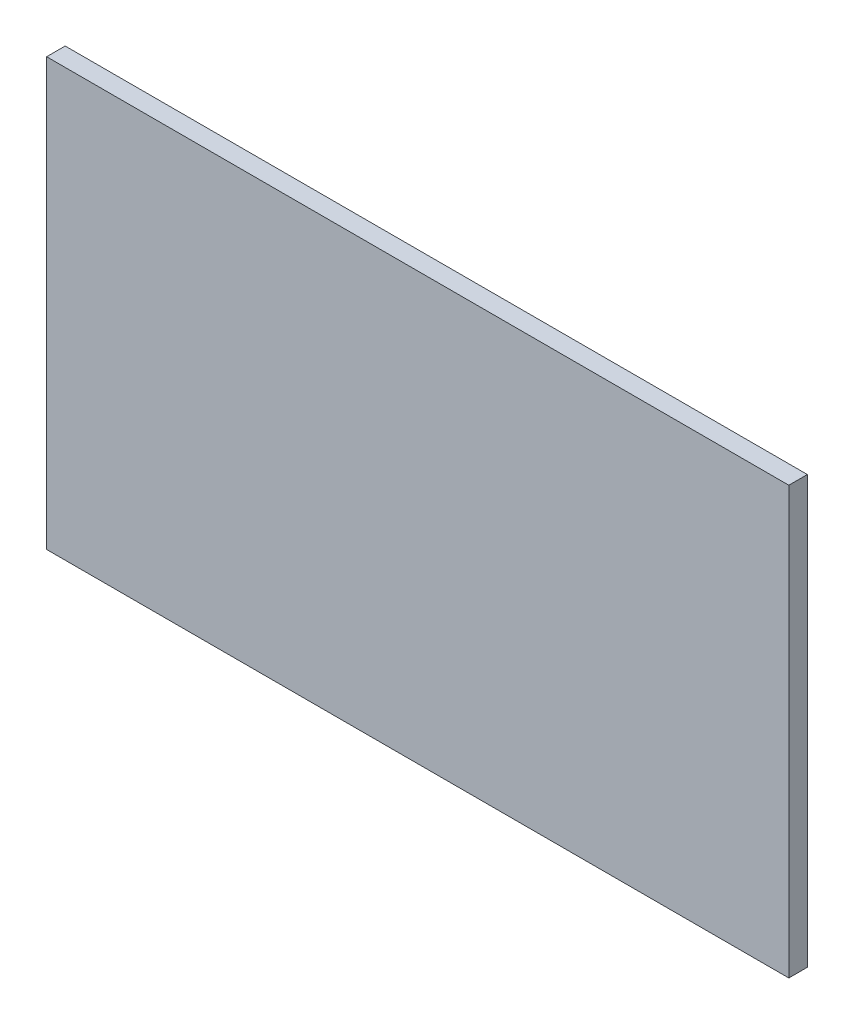
ISO-10303-21;
HEADER;
FILE_DESCRIPTION(('STEP AP214'),'2;1');
FILE_NAME('part.step','',(''),(''),'','','');
FILE_SCHEMA(('AUTOMOTIVE_DESIGN { 1 0 10303 214 1 1 1 1 }'));
ENDSEC;
DATA;
#1=APPLICATION_CONTEXT('core data for automotive mechanical design processes');
#2=APPLICATION_PROTOCOL_DEFINITION('international standard','automotive_design',2000,#1);
#3=PRODUCT_CONTEXT('',#1,'mechanical');
#4=PRODUCT('Part','Part','',(#3));
#5=PRODUCT_RELATED_PRODUCT_CATEGORY('part','',(#4));
#6=PRODUCT_DEFINITION_FORMATION('','',#4);
#7=PRODUCT_DEFINITION_CONTEXT('part definition',#1,'design');
#8=PRODUCT_DEFINITION('design','',#6,#7);
#9=PRODUCT_DEFINITION_SHAPE('','',#8);
#10=(LENGTH_UNIT() NAMED_UNIT(*) SI_UNIT(.MILLI.,.METRE.));
#11=(NAMED_UNIT(*) PLANE_ANGLE_UNIT() SI_UNIT($,.RADIAN.));
#12=(NAMED_UNIT(*) SI_UNIT($,.STERADIAN.) SOLID_ANGLE_UNIT());
#13=UNCERTAINTY_MEASURE_WITH_UNIT(LENGTH_MEASURE(1.E-05),#10,'distance_accuracy_value','');
#14=(GEOMETRIC_REPRESENTATION_CONTEXT(3) GLOBAL_UNCERTAINTY_ASSIGNED_CONTEXT((#13)) GLOBAL_UNIT_ASSIGNED_CONTEXT((#10,
#11,#12)) REPRESENTATION_CONTEXT('',''));
#15=CARTESIAN_POINT('',(0.,0.,0.));
#16=DIRECTION('',(0.,0.,1.));
#17=DIRECTION('',(1.,0.,0.));
#18=AXIS2_PLACEMENT_3D('',#15,#16,#17);
#19=CARTESIAN_POINT('',(400.,-230.,20.));
#20=DIRECTION('',(-1.,0.,0.));
#21=DIRECTION('',(0.,0.,1.));
#22=AXIS2_PLACEMENT_3D('',#19,#20,#21);
#23=PLANE('',#22);
#24=DIRECTION('',(0.,1.,0.));
#25=VECTOR('',#24,1.);
#26=CARTESIAN_POINT('',(400.,-230.,0.));
#27=LINE('',#26,#25);
#28=CARTESIAN_POINT('',(400.,-230.,0.));
#29=VERTEX_POINT('',#28);
#30=CARTESIAN_POINT('',(400.,230.,0.));
#31=VERTEX_POINT('',#30);
#32=EDGE_CURVE('E95',#29,#31,#27,.T.);
#33=ORIENTED_EDGE('',*,*,#32,.T.);
#34=DIRECTION('',(0.,0.,-1.));
#35=VECTOR('',#34,1.);
#36=CARTESIAN_POINT('',(400.,230.,20.));
#37=LINE('',#36,#35);
#38=CARTESIAN_POINT('',(400.,230.,20.));
#39=VERTEX_POINT('',#38);
#40=EDGE_CURVE('E11',#39,#31,#37,.T.);
#41=ORIENTED_EDGE('',*,*,#40,.F.);
#42=DIRECTION('',(0.,1.,0.));
#43=VECTOR('',#42,1.);
#44=CARTESIAN_POINT('',(400.,-230.,20.));
#45=LINE('',#44,#43);
#46=CARTESIAN_POINT('',(400.,-230.,20.));
#47=VERTEX_POINT('',#46);
#48=EDGE_CURVE('E83',#47,#39,#45,.T.);
#49=ORIENTED_EDGE('',*,*,#48,.F.);
#50=DIRECTION('',(0.,0.,-1.));
#51=VECTOR('',#50,1.);
#52=CARTESIAN_POINT('',(400.,-230.,20.));
#53=LINE('',#52,#51);
#54=EDGE_CURVE('E91',#47,#29,#53,.T.);
#55=ORIENTED_EDGE('',*,*,#54,.T.);
#56=EDGE_LOOP('',(#33,#41,#49,#55));
#57=FACE_BOUND('',#56,.T.);
#58=ADVANCED_FACE('F32',(#57),#23,.F.);
#59=CARTESIAN_POINT('',(-400.,230.,20.));
#60=DIRECTION('',(0.,-1.,0.));
#61=DIRECTION('',(0.,0.,-1.));
#62=AXIS2_PLACEMENT_3D('',#59,#60,#61);
#63=PLANE('',#62);
#64=DIRECTION('',(-1.,0.,0.));
#65=VECTOR('',#64,1.);
#66=CARTESIAN_POINT('',(-400.,230.,0.));
#67=LINE('',#66,#65);
#68=CARTESIAN_POINT('',(-400.,230.,0.));
#69=VERTEX_POINT('',#68);
#70=EDGE_CURVE('E87',#31,#69,#67,.T.);
#71=ORIENTED_EDGE('',*,*,#70,.T.);
#72=DIRECTION('',(0.,0.,-1.));
#73=VECTOR('',#72,1.);
#74=CARTESIAN_POINT('',(-400.,230.,20.));
#75=LINE('',#74,#73);
#76=CARTESIAN_POINT('',(-400.,230.,20.));
#77=VERTEX_POINT('',#76);
#78=EDGE_CURVE('E40',#77,#69,#75,.T.);
#79=ORIENTED_EDGE('',*,*,#78,.F.);
#80=DIRECTION('',(-1.,0.,0.));
#81=VECTOR('',#80,1.);
#82=CARTESIAN_POINT('',(-400.,230.,20.));
#83=LINE('',#82,#81);
#84=EDGE_CURVE('E78',#39,#77,#83,.T.);
#85=ORIENTED_EDGE('',*,*,#84,.F.);
#86=ORIENTED_EDGE('',*,*,#40,.T.);
#87=EDGE_LOOP('',(#71,#79,#85,#86));
#88=FACE_BOUND('',#87,.T.);
#89=ADVANCED_FACE('F86',(#88),#63,.F.);
#90=CARTESIAN_POINT('',(-400.,-230.,20.));
#91=DIRECTION('',(1.,0.,0.));
#92=DIRECTION('',(0.,0.,-1.));
#93=AXIS2_PLACEMENT_3D('',#90,#91,#92);
#94=PLANE('',#93);
#95=DIRECTION('',(0.,-1.,0.));
#96=VECTOR('',#95,1.);
#97=CARTESIAN_POINT('',(-400.,-230.,0.));
#98=LINE('',#97,#96);
#99=CARTESIAN_POINT('',(-400.,-230.,0.));
#100=VERTEX_POINT('',#99);
#101=EDGE_CURVE('E65',#69,#100,#98,.T.);
#102=ORIENTED_EDGE('',*,*,#101,.T.);
#103=DIRECTION('',(0.,0.,-1.));
#104=VECTOR('',#103,1.);
#105=CARTESIAN_POINT('',(-400.,-230.,20.));
#106=LINE('',#105,#104);
#107=CARTESIAN_POINT('',(-400.,-230.,20.));
#108=VERTEX_POINT('',#107);
#109=EDGE_CURVE('E88',#108,#100,#106,.T.);
#110=ORIENTED_EDGE('',*,*,#109,.F.);
#111=DIRECTION('',(0.,-1.,0.));
#112=VECTOR('',#111,1.);
#113=CARTESIAN_POINT('',(-400.,-230.,20.));
#114=LINE('',#113,#112);
#115=EDGE_CURVE('E81',#77,#108,#114,.T.);
#116=ORIENTED_EDGE('',*,*,#115,.F.);
#117=ORIENTED_EDGE('',*,*,#78,.T.);
#118=EDGE_LOOP('',(#102,#110,#116,#117));
#119=FACE_BOUND('',#118,.T.);
#120=ADVANCED_FACE('F89',(#119),#94,.F.);
#121=CARTESIAN_POINT('',(-400.,-230.,20.));
#122=DIRECTION('',(0.,1.,0.));
#123=DIRECTION('',(0.,0.,1.));
#124=AXIS2_PLACEMENT_3D('',#121,#122,#123);
#125=PLANE('',#124);
#126=DIRECTION('',(1.,0.,0.));
#127=VECTOR('',#126,1.);
#128=CARTESIAN_POINT('',(-400.,-230.,0.));
#129=LINE('',#128,#127);
#130=EDGE_CURVE('E71',#100,#29,#129,.T.);
#131=ORIENTED_EDGE('',*,*,#130,.T.);
#132=ORIENTED_EDGE('',*,*,#54,.F.);
#133=DIRECTION('',(1.,0.,0.));
#134=VECTOR('',#133,1.);
#135=CARTESIAN_POINT('',(-400.,-230.,20.));
#136=LINE('',#135,#134);
#137=EDGE_CURVE('E48',#108,#47,#136,.T.);
#138=ORIENTED_EDGE('',*,*,#137,.F.);
#139=ORIENTED_EDGE('',*,*,#109,.T.);
#140=EDGE_LOOP('',(#131,#132,#138,#139));
#141=FACE_BOUND('',#140,.T.);
#142=ADVANCED_FACE('F102',(#141),#125,.F.);
#143=CARTESIAN_POINT('',(0.,0.,20.));
#144=DIRECTION('',(0.,0.,-1.));
#145=DIRECTION('',(-1.,0.,0.));
#146=AXIS2_PLACEMENT_3D('',#143,#144,#145);
#147=PLANE('',#146);
#148=ORIENTED_EDGE('',*,*,#48,.T.);
#149=ORIENTED_EDGE('',*,*,#84,.T.);
#150=ORIENTED_EDGE('',*,*,#115,.T.);
#151=ORIENTED_EDGE('',*,*,#137,.T.);
#152=EDGE_LOOP('',(#148,#149,#150,#151));
#153=FACE_BOUND('',#152,.T.);
#154=ADVANCED_FACE('F79',(#153),#147,.F.);
#155=CARTESIAN_POINT('',(0.,0.,0.));
#156=DIRECTION('',(0.,0.,-1.));
#157=DIRECTION('',(-1.,0.,0.));
#158=AXIS2_PLACEMENT_3D('',#155,#156,#157);
#159=PLANE('',#158);
#160=ORIENTED_EDGE('',*,*,#32,.F.);
#161=ORIENTED_EDGE('',*,*,#130,.F.);
#162=ORIENTED_EDGE('',*,*,#101,.F.);
#163=ORIENTED_EDGE('',*,*,#70,.F.);
#164=EDGE_LOOP('',(#160,#161,#162,#163));
#165=FACE_BOUND('',#164,.T.);
#166=ADVANCED_FACE('F105',(#165),#159,.T.);
#167=CLOSED_SHELL('',(#58,#89,#120,#142,#154,#166));
#168=MANIFOLD_SOLID_BREP('B2',#167);
#169=ADVANCED_BREP_SHAPE_REPRESENTATION('',(#18,#168),#14);
#170=SHAPE_DEFINITION_REPRESENTATION(#9,#169);
ENDSEC;
END-ISO-10303-21;
